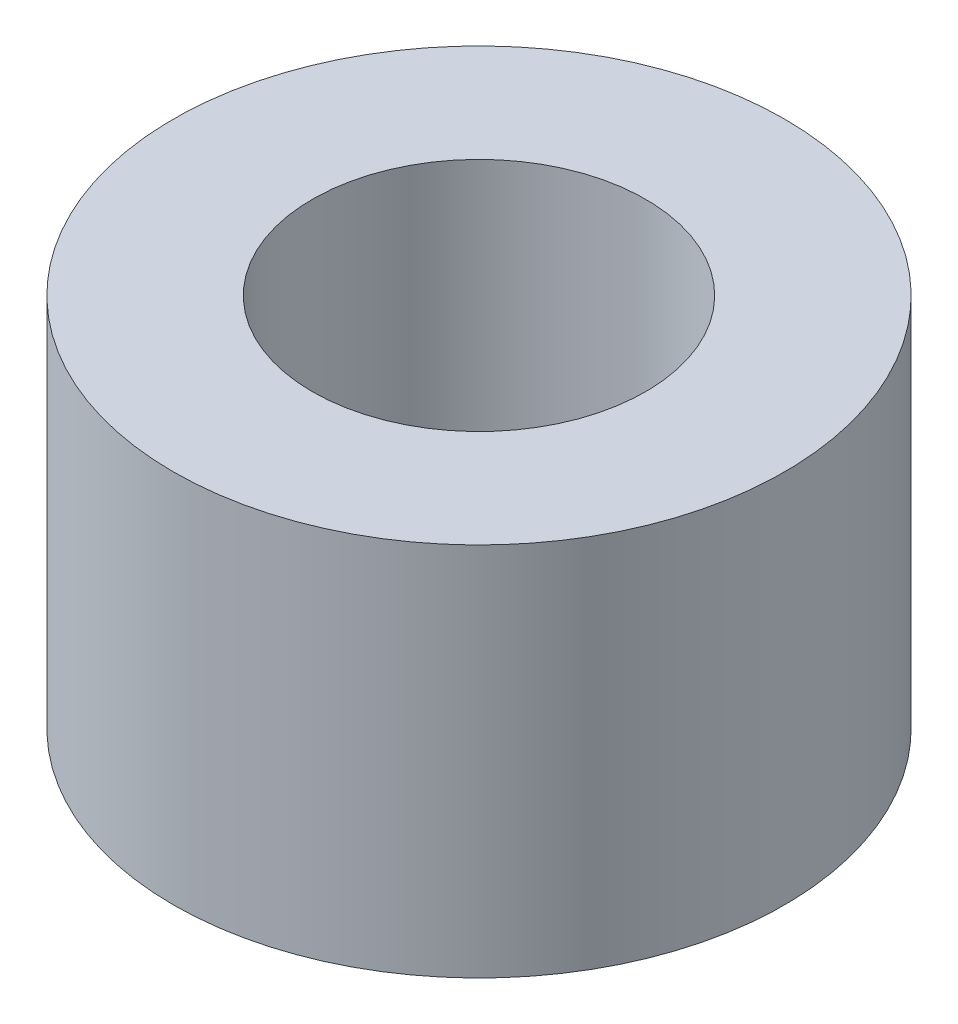
ISO-10303-21;
HEADER;
FILE_DESCRIPTION(('STEP AP214'),'2;1');
FILE_NAME('part.step','',(''),(''),'','','');
FILE_SCHEMA(('AUTOMOTIVE_DESIGN { 1 0 10303 214 1 1 1 1 }'));
ENDSEC;
DATA;
#1=APPLICATION_CONTEXT('core data for automotive mechanical design processes');
#2=APPLICATION_PROTOCOL_DEFINITION('international standard','automotive_design',2000,#1);
#3=PRODUCT_CONTEXT('',#1,'mechanical');
#4=PRODUCT('Part','Part','',(#3));
#5=PRODUCT_RELATED_PRODUCT_CATEGORY('part','',(#4));
#6=PRODUCT_DEFINITION_FORMATION('','',#4);
#7=PRODUCT_DEFINITION_CONTEXT('part definition',#1,'design');
#8=PRODUCT_DEFINITION('design','',#6,#7);
#9=PRODUCT_DEFINITION_SHAPE('','',#8);
#10=(LENGTH_UNIT() NAMED_UNIT(*) SI_UNIT(.MILLI.,.METRE.));
#11=(NAMED_UNIT(*) PLANE_ANGLE_UNIT() SI_UNIT($,.RADIAN.));
#12=(NAMED_UNIT(*) SI_UNIT($,.STERADIAN.) SOLID_ANGLE_UNIT());
#13=UNCERTAINTY_MEASURE_WITH_UNIT(LENGTH_MEASURE(1.E-05),#10,'distance_accuracy_value','');
#14=(GEOMETRIC_REPRESENTATION_CONTEXT(3) GLOBAL_UNCERTAINTY_ASSIGNED_CONTEXT((#13)) GLOBAL_UNIT_ASSIGNED_CONTEXT((#10,
#11,#12)) REPRESENTATION_CONTEXT('',''));
#15=CARTESIAN_POINT('',(0.,0.,0.));
#16=DIRECTION('',(0.,0.,1.));
#17=DIRECTION('',(1.,0.,0.));
#18=AXIS2_PLACEMENT_3D('',#15,#16,#17);
#19=CARTESIAN_POINT('',(0.,6.75,0.));
#20=DIRECTION('',(0.,1.,0.));
#21=DIRECTION('',(0.,0.,1.));
#22=AXIS2_PLACEMENT_3D('',#19,#20,#21);
#23=PLANE('',#22);
#24=CARTESIAN_POINT('',(0.,6.75,0.));
#25=DIRECTION('',(0.,1.,0.));
#26=DIRECTION('',(0.,0.,1.));
#27=AXIS2_PLACEMENT_3D('',#24,#25,#26);
#28=CIRCLE('',#27,5.5);
#29=CARTESIAN_POINT('',(0.,6.75,5.5));
#30=VERTEX_POINT('',#29);
#31=EDGE_CURVE('E10',#30,#30,#28,.T.);
#32=ORIENTED_EDGE('',*,*,#31,.T.);
#33=EDGE_LOOP('',(#32));
#34=FACE_BOUND('',#33,.T.);
#35=CARTESIAN_POINT('',(0.,6.75,0.));
#36=DIRECTION('',(0.,1.,0.));
#37=DIRECTION('',(0.,0.,1.));
#38=AXIS2_PLACEMENT_3D('',#35,#36,#37);
#39=CIRCLE('',#38,3.);
#40=CARTESIAN_POINT('',(0.,6.75,3.));
#41=VERTEX_POINT('',#40);
#42=EDGE_CURVE('E50',#41,#41,#39,.T.);
#43=ORIENTED_EDGE('',*,*,#42,.F.);
#44=EDGE_LOOP('',(#43));
#45=FACE_BOUND('',#44,.T.);
#46=ADVANCED_FACE('F37',(#34,#45),#23,.T.);
#47=CARTESIAN_POINT('',(0.,0.,0.));
#48=DIRECTION('',(0.,1.,0.));
#49=DIRECTION('',(0.,0.,1.));
#50=AXIS2_PLACEMENT_3D('',#47,#48,#49);
#51=PLANE('',#50);
#52=CARTESIAN_POINT('',(0.,0.,0.));
#53=DIRECTION('',(0.,1.,0.));
#54=DIRECTION('',(0.,0.,1.));
#55=AXIS2_PLACEMENT_3D('',#52,#53,#54);
#56=CIRCLE('',#55,5.5);
#57=CARTESIAN_POINT('',(0.,0.,5.5));
#58=VERTEX_POINT('',#57);
#59=EDGE_CURVE('E41',#58,#58,#56,.T.);
#60=ORIENTED_EDGE('',*,*,#59,.F.);
#61=EDGE_LOOP('',(#60));
#62=FACE_BOUND('',#61,.T.);
#63=CARTESIAN_POINT('',(0.,0.,0.));
#64=DIRECTION('',(0.,1.,0.));
#65=DIRECTION('',(0.,0.,1.));
#66=AXIS2_PLACEMENT_3D('',#63,#64,#65);
#67=CIRCLE('',#66,3.);
#68=CARTESIAN_POINT('',(0.,0.,3.));
#69=VERTEX_POINT('',#68);
#70=EDGE_CURVE('E52',#69,#69,#67,.T.);
#71=ORIENTED_EDGE('',*,*,#70,.T.);
#72=EDGE_LOOP('',(#71));
#73=FACE_BOUND('',#72,.T.);
#74=ADVANCED_FACE('F64',(#62,#73),#51,.F.);
#75=CARTESIAN_POINT('',(0.,6.75,0.));
#76=DIRECTION('',(0.,-1.,0.));
#77=DIRECTION('',(0.,0.,-1.));
#78=AXIS2_PLACEMENT_3D('',#75,#76,#77);
#79=CYLINDRICAL_SURFACE('',#78,5.5);
#80=ORIENTED_EDGE('',*,*,#31,.F.);
#81=EDGE_LOOP('',(#80));
#82=FACE_BOUND('',#81,.T.);
#83=ORIENTED_EDGE('',*,*,#59,.T.);
#84=EDGE_LOOP('',(#83));
#85=FACE_BOUND('',#84,.T.);
#86=ADVANCED_FACE('F39',(#82,#85),#79,.T.);
#87=CARTESIAN_POINT('',(0.,6.75,0.));
#88=DIRECTION('',(0.,-1.,0.));
#89=DIRECTION('',(0.,0.,-1.));
#90=AXIS2_PLACEMENT_3D('',#87,#88,#89);
#91=CYLINDRICAL_SURFACE('',#90,3.);
#92=ORIENTED_EDGE('',*,*,#42,.T.);
#93=EDGE_LOOP('',(#92));
#94=FACE_BOUND('',#93,.T.);
#95=ORIENTED_EDGE('',*,*,#70,.F.);
#96=EDGE_LOOP('',(#95));
#97=FACE_BOUND('',#96,.T.);
#98=ADVANCED_FACE('F60',(#94,#97),#91,.F.);
#99=CLOSED_SHELL('',(#46,#74,#86,#98));
#100=MANIFOLD_SOLID_BREP('B2',#99);
#101=ADVANCED_BREP_SHAPE_REPRESENTATION('',(#18,#100),#14);
#102=SHAPE_DEFINITION_REPRESENTATION(#9,#101);
ENDSEC;
END-ISO-10303-21;
